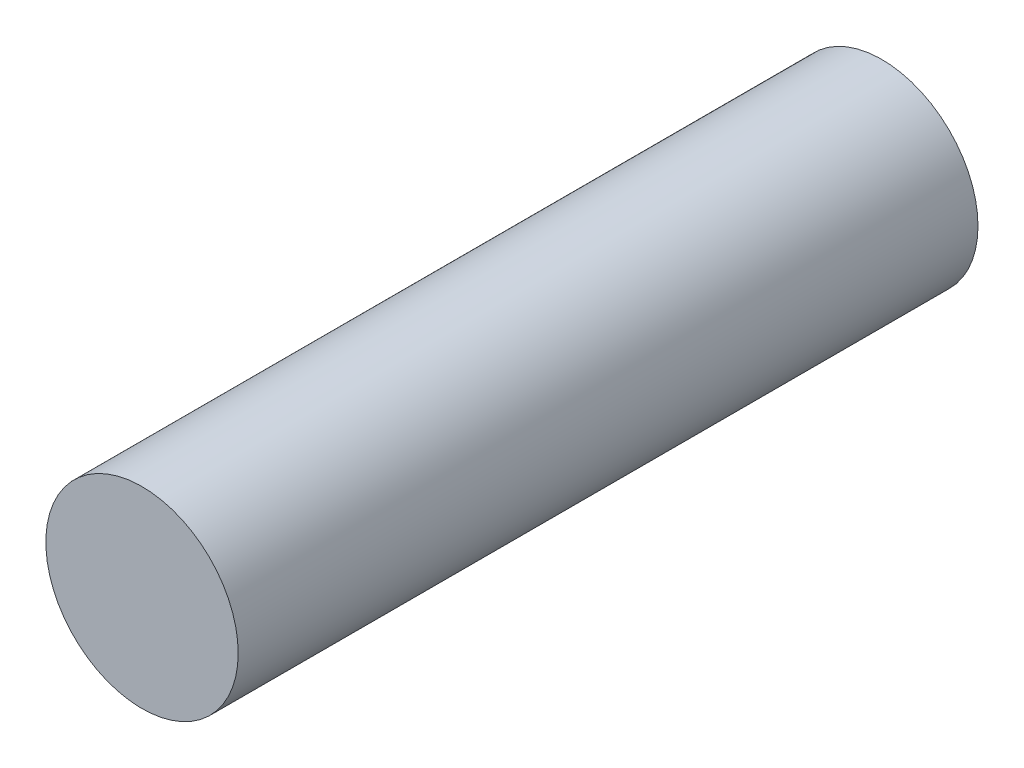
ISO-10303-21;
HEADER;
FILE_DESCRIPTION(('STEP AP214'),'2;1');
FILE_NAME('part.step','',(''),(''),'','','');
FILE_SCHEMA(('AUTOMOTIVE_DESIGN { 1 0 10303 214 1 1 1 1 }'));
ENDSEC;
DATA;
#1=APPLICATION_CONTEXT('core data for automotive mechanical design processes');
#2=APPLICATION_PROTOCOL_DEFINITION('international standard','automotive_design',2000,#1);
#3=PRODUCT_CONTEXT('',#1,'mechanical');
#4=PRODUCT('Part','Part','',(#3));
#5=PRODUCT_RELATED_PRODUCT_CATEGORY('part','',(#4));
#6=PRODUCT_DEFINITION_FORMATION('','',#4);
#7=PRODUCT_DEFINITION_CONTEXT('part definition',#1,'design');
#8=PRODUCT_DEFINITION('design','',#6,#7);
#9=PRODUCT_DEFINITION_SHAPE('','',#8);
#10=(LENGTH_UNIT() NAMED_UNIT(*) SI_UNIT(.MILLI.,.METRE.));
#11=(NAMED_UNIT(*) PLANE_ANGLE_UNIT() SI_UNIT($,.RADIAN.));
#12=(NAMED_UNIT(*) SI_UNIT($,.STERADIAN.) SOLID_ANGLE_UNIT());
#13=UNCERTAINTY_MEASURE_WITH_UNIT(LENGTH_MEASURE(1.E-05),#10,'distance_accuracy_value','');
#14=(GEOMETRIC_REPRESENTATION_CONTEXT(3) GLOBAL_UNCERTAINTY_ASSIGNED_CONTEXT((#13)) GLOBAL_UNIT_ASSIGNED_CONTEXT((#10,
#11,#12)) REPRESENTATION_CONTEXT('',''));
#15=CARTESIAN_POINT('',(0.,0.,0.));
#16=DIRECTION('',(0.,0.,1.));
#17=DIRECTION('',(1.,0.,0.));
#18=AXIS2_PLACEMENT_3D('',#15,#16,#17);
#19=CARTESIAN_POINT('',(0.,0.,5.));
#20=DIRECTION('',(0.,0.,-1.));
#21=DIRECTION('',(-1.,0.,0.));
#22=AXIS2_PLACEMENT_3D('',#19,#20,#21);
#23=CYLINDRICAL_SURFACE('',#22,0.649999999999998);
#24=CARTESIAN_POINT('',(0.,0.,5.));
#25=DIRECTION('',(0.,0.,1.));
#26=DIRECTION('',(1.,0.,0.));
#27=AXIS2_PLACEMENT_3D('',#24,#25,#26);
#28=CIRCLE('',#27,0.649999999999998);
#29=CARTESIAN_POINT('',(0.649999999999998,0.,5.));
#30=VERTEX_POINT('',#29);
#31=EDGE_CURVE('E10',#30,#30,#28,.T.);
#32=ORIENTED_EDGE('',*,*,#31,.F.);
#33=EDGE_LOOP('',(#32));
#34=FACE_BOUND('',#33,.T.);
#35=CARTESIAN_POINT('',(0.,0.,0.));
#36=DIRECTION('',(0.,0.,1.));
#37=DIRECTION('',(1.,0.,0.));
#38=AXIS2_PLACEMENT_3D('',#35,#36,#37);
#39=CIRCLE('',#38,0.649999999999998);
#40=CARTESIAN_POINT('',(0.649999999999998,0.,0.));
#41=VERTEX_POINT('',#40);
#42=EDGE_CURVE('E33',#41,#41,#39,.T.);
#43=ORIENTED_EDGE('',*,*,#42,.T.);
#44=EDGE_LOOP('',(#43));
#45=FACE_BOUND('',#44,.T.);
#46=ADVANCED_FACE('F30',(#34,#45),#23,.T.);
#47=CARTESIAN_POINT('',(0.,0.,5.));
#48=DIRECTION('',(0.,0.,1.));
#49=DIRECTION('',(1.,0.,0.));
#50=AXIS2_PLACEMENT_3D('',#47,#48,#49);
#51=PLANE('',#50);
#52=ORIENTED_EDGE('',*,*,#31,.T.);
#53=EDGE_LOOP('',(#52));
#54=FACE_BOUND('',#53,.T.);
#55=ADVANCED_FACE('F45',(#54),#51,.T.);
#56=CARTESIAN_POINT('',(0.,0.,0.));
#57=DIRECTION('',(0.,0.,1.));
#58=DIRECTION('',(1.,0.,0.));
#59=AXIS2_PLACEMENT_3D('',#56,#57,#58);
#60=PLANE('',#59);
#61=ORIENTED_EDGE('',*,*,#42,.F.);
#62=EDGE_LOOP('',(#61));
#63=FACE_BOUND('',#62,.T.);
#64=ADVANCED_FACE('F43',(#63),#60,.F.);
#65=CLOSED_SHELL('',(#46,#55,#64));
#66=MANIFOLD_SOLID_BREP('B2',#65);
#67=ADVANCED_BREP_SHAPE_REPRESENTATION('',(#18,#66),#14);
#68=SHAPE_DEFINITION_REPRESENTATION(#9,#67);
ENDSEC;
END-ISO-10303-21;
